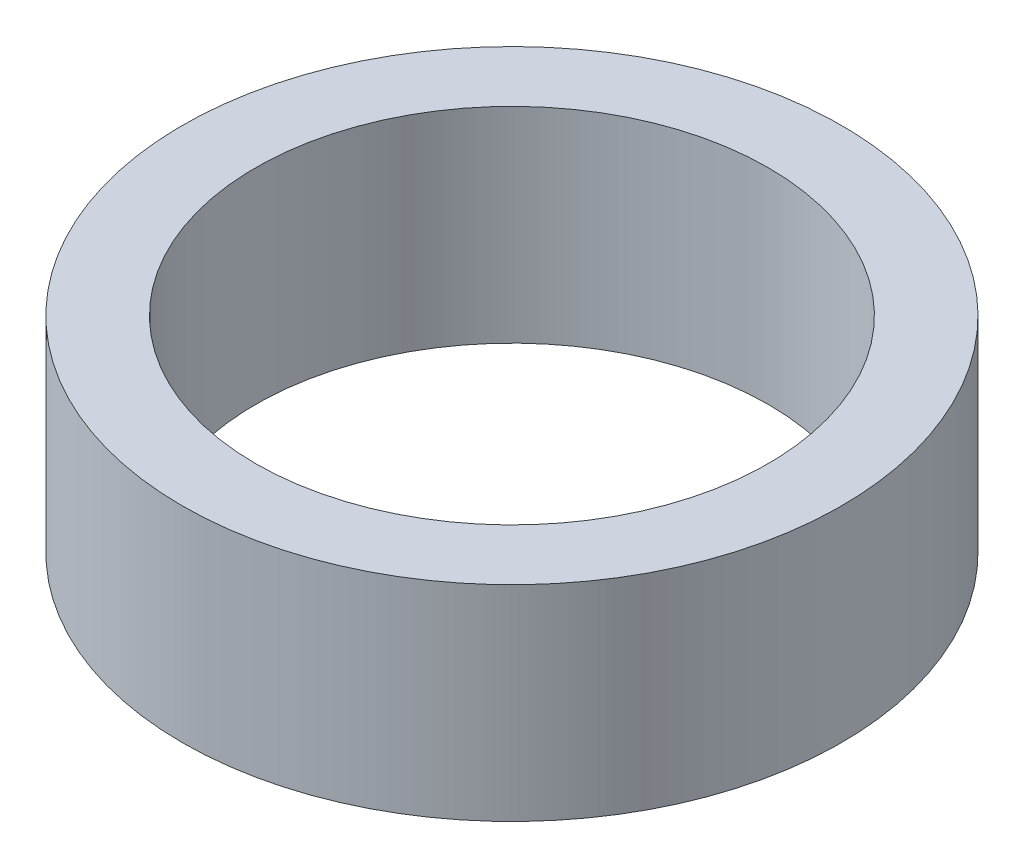
ISO-10303-21;
HEADER;
FILE_DESCRIPTION(('STEP AP214'),'2;1');
FILE_NAME('part.step','',(''),(''),'','','');
FILE_SCHEMA(('AUTOMOTIVE_DESIGN { 1 0 10303 214 1 1 1 1 }'));
ENDSEC;
DATA;
#1=APPLICATION_CONTEXT('core data for automotive mechanical design processes');
#2=APPLICATION_PROTOCOL_DEFINITION('international standard','automotive_design',2000,#1);
#3=PRODUCT_CONTEXT('',#1,'mechanical');
#4=PRODUCT('Part','Part','',(#3));
#5=PRODUCT_RELATED_PRODUCT_CATEGORY('part','',(#4));
#6=PRODUCT_DEFINITION_FORMATION('','',#4);
#7=PRODUCT_DEFINITION_CONTEXT('part definition',#1,'design');
#8=PRODUCT_DEFINITION('design','',#6,#7);
#9=PRODUCT_DEFINITION_SHAPE('','',#8);
#10=(LENGTH_UNIT() NAMED_UNIT(*) SI_UNIT(.MILLI.,.METRE.));
#11=(NAMED_UNIT(*) PLANE_ANGLE_UNIT() SI_UNIT($,.RADIAN.));
#12=(NAMED_UNIT(*) SI_UNIT($,.STERADIAN.) SOLID_ANGLE_UNIT());
#13=UNCERTAINTY_MEASURE_WITH_UNIT(LENGTH_MEASURE(1.E-05),#10,'distance_accuracy_value','');
#14=(GEOMETRIC_REPRESENTATION_CONTEXT(3) GLOBAL_UNCERTAINTY_ASSIGNED_CONTEXT((#13)) GLOBAL_UNIT_ASSIGNED_CONTEXT((#10,
#11,#12)) REPRESENTATION_CONTEXT('',''));
#15=CARTESIAN_POINT('',(0.,0.,0.));
#16=DIRECTION('',(0.,0.,1.));
#17=DIRECTION('',(1.,0.,0.));
#18=AXIS2_PLACEMENT_3D('',#15,#16,#17);
#19=CARTESIAN_POINT('',(0.,28.,0.));
#20=DIRECTION('',(0.,-1.,0.));
#21=DIRECTION('',(0.,0.,-1.));
#22=AXIS2_PLACEMENT_3D('',#19,#20,#21);
#23=CYLINDRICAL_SURFACE('',#22,45.);
#24=CARTESIAN_POINT('',(0.,28.,0.));
#25=DIRECTION('',(0.,1.,0.));
#26=DIRECTION('',(0.,0.,1.));
#27=AXIS2_PLACEMENT_3D('',#24,#25,#26);
#28=CIRCLE('',#27,45.);
#29=CARTESIAN_POINT('',(0.,28.,45.));
#30=VERTEX_POINT('',#29);
#31=EDGE_CURVE('E10',#30,#30,#28,.T.);
#32=ORIENTED_EDGE('',*,*,#31,.F.);
#33=EDGE_LOOP('',(#32));
#34=FACE_BOUND('',#33,.T.);
#35=CARTESIAN_POINT('',(0.,0.,0.));
#36=DIRECTION('',(0.,1.,0.));
#37=DIRECTION('',(0.,0.,1.));
#38=AXIS2_PLACEMENT_3D('',#35,#36,#37);
#39=CIRCLE('',#38,45.);
#40=CARTESIAN_POINT('',(0.,0.,45.));
#41=VERTEX_POINT('',#40);
#42=EDGE_CURVE('E37',#41,#41,#39,.T.);
#43=ORIENTED_EDGE('',*,*,#42,.T.);
#44=EDGE_LOOP('',(#43));
#45=FACE_BOUND('',#44,.T.);
#46=ADVANCED_FACE('F40',(#34,#45),#23,.T.);
#47=CARTESIAN_POINT('',(0.,28.,0.));
#48=DIRECTION('',(0.,1.,0.));
#49=DIRECTION('',(0.,0.,1.));
#50=AXIS2_PLACEMENT_3D('',#47,#48,#49);
#51=PLANE('',#50);
#52=CARTESIAN_POINT('',(0.,28.,0.));
#53=DIRECTION('',(0.,1.,0.));
#54=DIRECTION('',(0.,0.,1.));
#55=AXIS2_PLACEMENT_3D('',#52,#53,#54);
#56=CIRCLE('',#55,35.);
#57=CARTESIAN_POINT('',(0.,28.,35.));
#58=VERTEX_POINT('',#57);
#59=EDGE_CURVE('E50',#58,#58,#56,.T.);
#60=ORIENTED_EDGE('',*,*,#59,.F.);
#61=EDGE_LOOP('',(#60));
#62=FACE_BOUND('',#61,.T.);
#63=ORIENTED_EDGE('',*,*,#31,.T.);
#64=EDGE_LOOP('',(#63));
#65=FACE_BOUND('',#64,.T.);
#66=ADVANCED_FACE('F59',(#62,#65),#51,.T.);
#67=CARTESIAN_POINT('',(0.,0.,0.));
#68=DIRECTION('',(0.,1.,0.));
#69=DIRECTION('',(0.,0.,1.));
#70=AXIS2_PLACEMENT_3D('',#67,#68,#69);
#71=PLANE('',#70);
#72=CARTESIAN_POINT('',(0.,0.,0.));
#73=DIRECTION('',(0.,1.,0.));
#74=DIRECTION('',(0.,0.,1.));
#75=AXIS2_PLACEMENT_3D('',#72,#73,#74);
#76=CIRCLE('',#75,35.);
#77=CARTESIAN_POINT('',(0.,0.,35.));
#78=VERTEX_POINT('',#77);
#79=EDGE_CURVE('E47',#78,#78,#76,.T.);
#80=ORIENTED_EDGE('',*,*,#79,.T.);
#81=EDGE_LOOP('',(#80));
#82=FACE_BOUND('',#81,.T.);
#83=ORIENTED_EDGE('',*,*,#42,.F.);
#84=EDGE_LOOP('',(#83));
#85=FACE_BOUND('',#84,.T.);
#86=ADVANCED_FACE('F58',(#82,#85),#71,.F.);
#87=CARTESIAN_POINT('',(0.,28.,0.));
#88=DIRECTION('',(0.,-1.,0.));
#89=DIRECTION('',(0.,0.,-1.));
#90=AXIS2_PLACEMENT_3D('',#87,#88,#89);
#91=CYLINDRICAL_SURFACE('',#90,35.);
#92=ORIENTED_EDGE('',*,*,#59,.T.);
#93=EDGE_LOOP('',(#92));
#94=FACE_BOUND('',#93,.T.);
#95=ORIENTED_EDGE('',*,*,#79,.F.);
#96=EDGE_LOOP('',(#95));
#97=FACE_BOUND('',#96,.T.);
#98=ADVANCED_FACE('F54',(#94,#97),#91,.F.);
#99=CLOSED_SHELL('',(#46,#66,#86,#98));
#100=MANIFOLD_SOLID_BREP('B2',#99);
#101=ADVANCED_BREP_SHAPE_REPRESENTATION('',(#18,#100),#14);
#102=SHAPE_DEFINITION_REPRESENTATION(#9,#101);
ENDSEC;
END-ISO-10303-21;
